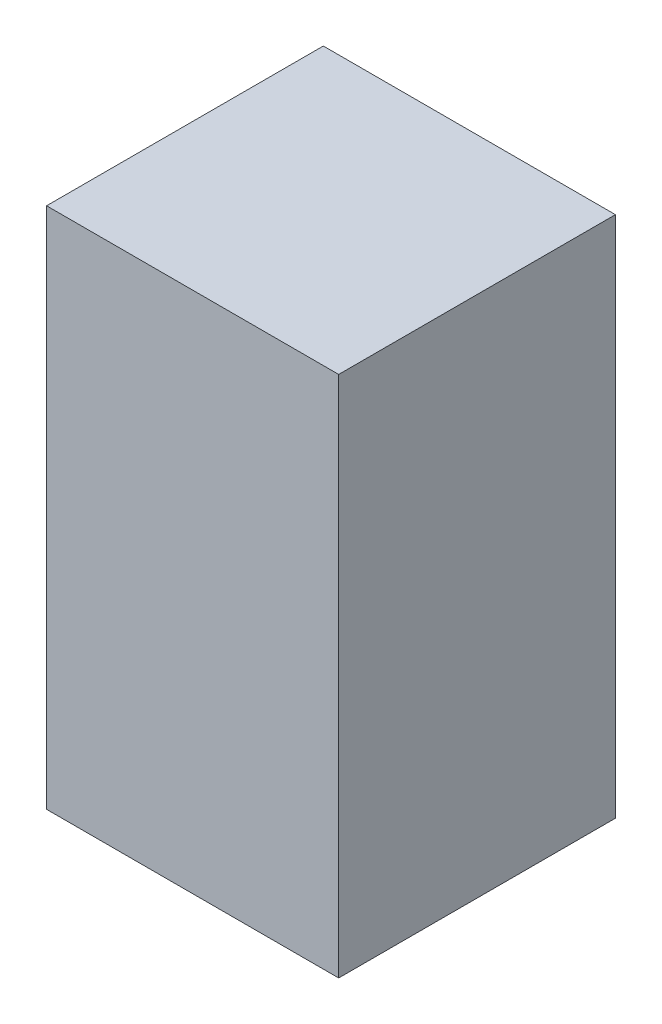
ISO-10303-21;
HEADER;
FILE_DESCRIPTION(('STEP AP214'),'2;1');
FILE_NAME('part.step','',(''),(''),'','','');
FILE_SCHEMA(('AUTOMOTIVE_DESIGN { 1 0 10303 214 1 1 1 1 }'));
ENDSEC;
DATA;
#1=APPLICATION_CONTEXT('core data for automotive mechanical design processes');
#2=APPLICATION_PROTOCOL_DEFINITION('international standard','automotive_design',2000,#1);
#3=PRODUCT_CONTEXT('',#1,'mechanical');
#4=PRODUCT('Part','Part','',(#3));
#5=PRODUCT_RELATED_PRODUCT_CATEGORY('part','',(#4));
#6=PRODUCT_DEFINITION_FORMATION('','',#4);
#7=PRODUCT_DEFINITION_CONTEXT('part definition',#1,'design');
#8=PRODUCT_DEFINITION('design','',#6,#7);
#9=PRODUCT_DEFINITION_SHAPE('','',#8);
#10=(LENGTH_UNIT() NAMED_UNIT(*) SI_UNIT(.MILLI.,.METRE.));
#11=(NAMED_UNIT(*) PLANE_ANGLE_UNIT() SI_UNIT($,.RADIAN.));
#12=(NAMED_UNIT(*) SI_UNIT($,.STERADIAN.) SOLID_ANGLE_UNIT());
#13=UNCERTAINTY_MEASURE_WITH_UNIT(LENGTH_MEASURE(1.E-05),#10,'distance_accuracy_value','');
#14=(GEOMETRIC_REPRESENTATION_CONTEXT(3) GLOBAL_UNCERTAINTY_ASSIGNED_CONTEXT((#13)) GLOBAL_UNIT_ASSIGNED_CONTEXT((#10,
#11,#12)) REPRESENTATION_CONTEXT('',''));
#15=CARTESIAN_POINT('',(0.,0.,0.));
#16=DIRECTION('',(0.,0.,1.));
#17=DIRECTION('',(1.,0.,0.));
#18=AXIS2_PLACEMENT_3D('',#15,#16,#17);
#19=CARTESIAN_POINT('',(0.47500032,-0.85000084,0.90000074));
#20=DIRECTION('',(0.,0.,-1.));
#21=DIRECTION('',(-1.,0.,0.));
#22=AXIS2_PLACEMENT_3D('',#19,#20,#21);
#23=PLANE('',#22);
#24=DIRECTION('',(1.,0.,0.));
#25=VECTOR('',#24,1.);
#26=CARTESIAN_POINT('',(0.47500032,0.85000084,0.90000074));
#27=LINE('',#26,#25);
#28=CARTESIAN_POINT('',(0.47500032,0.85000084,0.90000074));
#29=VERTEX_POINT('',#28);
#30=CARTESIAN_POINT('',(-0.47500032,0.85000084,0.90000074));
#31=VERTEX_POINT('',#30);
#32=EDGE_CURVE('E55',#29,#31,#27,.F.);
#33=ORIENTED_EDGE('',*,*,#32,.T.);
#34=DIRECTION('',(0.,1.,0.));
#35=VECTOR('',#34,1.);
#36=CARTESIAN_POINT('',(-0.47500032,0.85000084,0.90000074));
#37=LINE('',#36,#35);
#38=CARTESIAN_POINT('',(-0.47500032,-0.85000084,0.90000074));
#39=VERTEX_POINT('',#38);
#40=EDGE_CURVE('E57',#31,#39,#37,.F.);
#41=ORIENTED_EDGE('',*,*,#40,.T.);
#42=DIRECTION('',(1.,0.,0.));
#43=VECTOR('',#42,1.);
#44=CARTESIAN_POINT('',(-0.47500032,-0.85000084,0.90000074));
#45=LINE('',#44,#43);
#46=CARTESIAN_POINT('',(0.47500032,-0.85000084,0.90000074));
#47=VERTEX_POINT('',#46);
#48=EDGE_CURVE('E20',#39,#47,#45,.T.);
#49=ORIENTED_EDGE('',*,*,#48,.T.);
#50=DIRECTION('',(0.,1.,0.));
#51=VECTOR('',#50,1.);
#52=CARTESIAN_POINT('',(0.47500032,-0.85000084,0.90000074));
#53=LINE('',#52,#51);
#54=EDGE_CURVE('E80',#47,#29,#53,.T.);
#55=ORIENTED_EDGE('',*,*,#54,.T.);
#56=EDGE_LOOP('',(#33,#41,#49,#55));
#57=FACE_BOUND('',#56,.T.);
#58=ADVANCED_FACE('F17',(#57),#23,.F.);
#59=CARTESIAN_POINT('',(-0.47500032,-0.85000084,0.));
#60=DIRECTION('',(0.,1.,0.));
#61=DIRECTION('',(0.,0.,1.));
#62=AXIS2_PLACEMENT_3D('',#59,#60,#61);
#63=PLANE('',#62);
#64=DIRECTION('',(0.,0.,1.));
#65=VECTOR('',#64,1.);
#66=CARTESIAN_POINT('',(0.47500032,-0.85000084,0.));
#67=LINE('',#66,#65);
#68=CARTESIAN_POINT('',(0.47500032,-0.85000084,0.));
#69=VERTEX_POINT('',#68);
#70=EDGE_CURVE('E68',#69,#47,#67,.T.);
#71=ORIENTED_EDGE('',*,*,#70,.T.);
#72=ORIENTED_EDGE('',*,*,#48,.F.);
#73=DIRECTION('',(0.,0.,-1.));
#74=VECTOR('',#73,1.);
#75=CARTESIAN_POINT('',(-0.47500032,-0.85000084,0.));
#76=LINE('',#75,#74);
#77=CARTESIAN_POINT('',(-0.47500032,-0.85000084,0.));
#78=VERTEX_POINT('',#77);
#79=EDGE_CURVE('E63',#39,#78,#76,.T.);
#80=ORIENTED_EDGE('',*,*,#79,.T.);
#81=DIRECTION('',(-1.,0.,0.));
#82=VECTOR('',#81,1.);
#83=CARTESIAN_POINT('',(0.47500032,-0.85000084,0.));
#84=LINE('',#83,#82);
#85=EDGE_CURVE('E83',#69,#78,#84,.T.);
#86=ORIENTED_EDGE('',*,*,#85,.F.);
#87=EDGE_LOOP('',(#71,#72,#80,#86));
#88=FACE_BOUND('',#87,.T.);
#89=ADVANCED_FACE('F65',(#88),#63,.F.);
#90=CARTESIAN_POINT('',(-0.47500032,0.85000084,0.));
#91=DIRECTION('',(1.,0.,0.));
#92=DIRECTION('',(0.,0.,-1.));
#93=AXIS2_PLACEMENT_3D('',#90,#91,#92);
#94=PLANE('',#93);
#95=ORIENTED_EDGE('',*,*,#79,.F.);
#96=ORIENTED_EDGE('',*,*,#40,.F.);
#97=DIRECTION('',(0.,0.,-1.));
#98=VECTOR('',#97,1.);
#99=CARTESIAN_POINT('',(-0.47500032,0.85000084,0.));
#100=LINE('',#99,#98);
#101=CARTESIAN_POINT('',(-0.47500032,0.85000084,0.));
#102=VERTEX_POINT('',#101);
#103=EDGE_CURVE('E75',#31,#102,#100,.T.);
#104=ORIENTED_EDGE('',*,*,#103,.T.);
#105=DIRECTION('',(0.,1.,0.));
#106=VECTOR('',#105,1.);
#107=CARTESIAN_POINT('',(-0.47500032,-0.85000084,0.));
#108=LINE('',#107,#106);
#109=EDGE_CURVE('E72',#78,#102,#108,.T.);
#110=ORIENTED_EDGE('',*,*,#109,.F.);
#111=EDGE_LOOP('',(#95,#96,#104,#110));
#112=FACE_BOUND('',#111,.T.);
#113=ADVANCED_FACE('F70',(#112),#94,.F.);
#114=CARTESIAN_POINT('',(0.47500032,0.85000084,0.));
#115=DIRECTION('',(0.,-1.,0.));
#116=DIRECTION('',(0.,0.,-1.));
#117=AXIS2_PLACEMENT_3D('',#114,#115,#116);
#118=PLANE('',#117);
#119=ORIENTED_EDGE('',*,*,#103,.F.);
#120=ORIENTED_EDGE('',*,*,#32,.F.);
#121=DIRECTION('',(0.,0.,1.));
#122=VECTOR('',#121,1.);
#123=CARTESIAN_POINT('',(0.47500032,0.85000084,0.));
#124=LINE('',#123,#122);
#125=CARTESIAN_POINT('',(0.47500032,0.85000084,0.));
#126=VERTEX_POINT('',#125);
#127=EDGE_CURVE('E35',#29,#126,#124,.F.);
#128=ORIENTED_EDGE('',*,*,#127,.T.);
#129=DIRECTION('',(-1.,0.,0.));
#130=VECTOR('',#129,1.);
#131=CARTESIAN_POINT('',(0.47500032,0.85000084,0.));
#132=LINE('',#131,#130);
#133=EDGE_CURVE('E26',#102,#126,#132,.F.);
#134=ORIENTED_EDGE('',*,*,#133,.F.);
#135=EDGE_LOOP('',(#119,#120,#128,#134));
#136=FACE_BOUND('',#135,.T.);
#137=ADVANCED_FACE('F89',(#136),#118,.F.);
#138=CARTESIAN_POINT('',(0.47500032,-0.85000084,0.));
#139=DIRECTION('',(-1.,0.,0.));
#140=DIRECTION('',(0.,0.,1.));
#141=AXIS2_PLACEMENT_3D('',#138,#139,#140);
#142=PLANE('',#141);
#143=ORIENTED_EDGE('',*,*,#127,.F.);
#144=ORIENTED_EDGE('',*,*,#54,.F.);
#145=ORIENTED_EDGE('',*,*,#70,.F.);
#146=DIRECTION('',(0.,1.,0.));
#147=VECTOR('',#146,1.);
#148=CARTESIAN_POINT('',(0.47500032,-0.85000084,0.));
#149=LINE('',#148,#147);
#150=EDGE_CURVE('E11',#126,#69,#149,.F.);
#151=ORIENTED_EDGE('',*,*,#150,.F.);
#152=EDGE_LOOP('',(#143,#144,#145,#151));
#153=FACE_BOUND('',#152,.T.);
#154=ADVANCED_FACE('F91',(#153),#142,.F.);
#155=CARTESIAN_POINT('',(0.47500032,-0.85000084,0.));
#156=DIRECTION('',(0.,0.,-1.));
#157=DIRECTION('',(-1.,0.,0.));
#158=AXIS2_PLACEMENT_3D('',#155,#156,#157);
#159=PLANE('',#158);
#160=ORIENTED_EDGE('',*,*,#133,.T.);
#161=ORIENTED_EDGE('',*,*,#150,.T.);
#162=ORIENTED_EDGE('',*,*,#85,.T.);
#163=ORIENTED_EDGE('',*,*,#109,.T.);
#164=EDGE_LOOP('',(#160,#161,#162,#163));
#165=FACE_BOUND('',#164,.T.);
#166=ADVANCED_FACE('F88',(#165),#159,.T.);
#167=CLOSED_SHELL('',(#58,#89,#113,#137,#154,#166));
#168=MANIFOLD_SOLID_BREP('B1',#167);
#169=ADVANCED_BREP_SHAPE_REPRESENTATION('',(#18,#168),#14);
#170=SHAPE_DEFINITION_REPRESENTATION(#9,#169);
ENDSEC;
END-ISO-10303-21;
